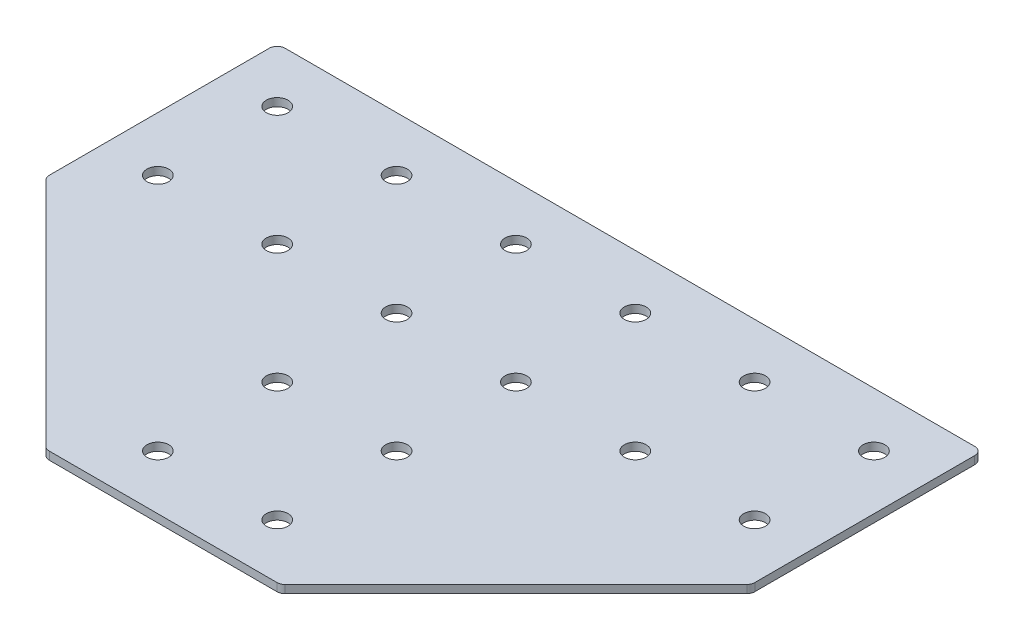
ISO-10303-21;
HEADER;
FILE_DESCRIPTION(('STEP AP214'),'2;1');
FILE_NAME('part.step','',(''),(''),'','','');
FILE_SCHEMA(('AUTOMOTIVE_DESIGN { 1 0 10303 214 1 1 1 1 }'));
ENDSEC;
DATA;
#1=APPLICATION_CONTEXT('core data for automotive mechanical design processes');
#2=APPLICATION_PROTOCOL_DEFINITION('international standard','automotive_design',2000,#1);
#3=PRODUCT_CONTEXT('',#1,'mechanical');
#4=PRODUCT('Part','Part','',(#3));
#5=PRODUCT_RELATED_PRODUCT_CATEGORY('part','',(#4));
#6=PRODUCT_DEFINITION_FORMATION('','',#4);
#7=PRODUCT_DEFINITION_CONTEXT('part definition',#1,'design');
#8=PRODUCT_DEFINITION('design','',#6,#7);
#9=PRODUCT_DEFINITION_SHAPE('','',#8);
#10=(LENGTH_UNIT() NAMED_UNIT(*) SI_UNIT(.MILLI.,.METRE.));
#11=(NAMED_UNIT(*) PLANE_ANGLE_UNIT() SI_UNIT($,.RADIAN.));
#12=(NAMED_UNIT(*) SI_UNIT($,.STERADIAN.) SOLID_ANGLE_UNIT());
#13=UNCERTAINTY_MEASURE_WITH_UNIT(LENGTH_MEASURE(1.E-05),#10,'distance_accuracy_value','');
#14=(GEOMETRIC_REPRESENTATION_CONTEXT(3) GLOBAL_UNCERTAINTY_ASSIGNED_CONTEXT((#13)) GLOBAL_UNIT_ASSIGNED_CONTEXT((#10,
#11,#12)) REPRESENTATION_CONTEXT('',''));
#15=CARTESIAN_POINT('',(0.,0.,0.));
#16=DIRECTION('',(0.,0.,1.));
#17=DIRECTION('',(1.,0.,0.));
#18=AXIS2_PLACEMENT_3D('',#15,#16,#17);
#19=CARTESIAN_POINT('',(-1.82872212002394,1.20798729377475,-45.8788250855786));
#20=DIRECTION('',(0.,-1.,0.));
#21=DIRECTION('',(0.,0.,-1.));
#22=AXIS2_PLACEMENT_3D('',#19,#20,#21);
#23=PLANE('',#22);
#24=DIRECTION('',(1.,0.,0.));
#25=VECTOR('',#24,1.);
#26=CARTESIAN_POINT('',(-44.828722120024,1.20798729377475,87.1211749144213));
#27=LINE('',#26,#25);
#28=CARTESIAN_POINT('',(-44.7576543081585,1.20798729377475,87.1211749144213));
#29=VERTEX_POINT('',#28);
#30=CARTESIAN_POINT('',(41.1002100681107,1.20798729377475,87.1211749144213));
#31=VERTEX_POINT('',#30);
#32=EDGE_CURVE('E218',#29,#31,#27,.T.);
#33=ORIENTED_EDGE('',*,*,#32,.F.);
#34=CARTESIAN_POINT('',(-44.7576543081585,1.20798729377475,84.1211749144213));
#35=DIRECTION('',(0.,1.,0.));
#36=DIRECTION('',(0.,0.,-1.));
#37=AXIS2_PLACEMENT_3D('',#34,#35,#36);
#38=CIRCLE('',#37,3.);
#39=CARTESIAN_POINT('',(-46.8789746517182,1.20798729377475,86.242495257981));
#40=VERTEX_POINT('',#39);
#41=EDGE_CURVE('E154',#40,#29,#38,.T.);
#42=ORIENTED_EDGE('',*,*,#41,.F.);
#43=DIRECTION('',(-0.707106781186547,0.,-0.707106781186548));
#44=VECTOR('',#43,1.);
#45=CARTESIAN_POINT('',(-46.0002949952778,1.20798729377475,87.1211749144213));
#46=LINE('',#45,#44);
#47=CARTESIAN_POINT('',(-133.950042463583,1.20798729377475,-0.828572553884362));
#48=VERTEX_POINT('',#47);
#49=EDGE_CURVE('E141',#40,#48,#46,.T.);
#50=ORIENTED_EDGE('',*,*,#49,.T.);
#51=CARTESIAN_POINT('',(-131.828722120024,1.20798729377475,-2.94989289744402));
#52=DIRECTION('',(0.,1.,0.));
#53=DIRECTION('',(0.,0.,-1.));
#54=AXIS2_PLACEMENT_3D('',#51,#52,#53);
#55=CIRCLE('',#54,3.);
#56=CARTESIAN_POINT('',(-134.828722120024,1.20798729377475,-2.94989289744401));
#57=VERTEX_POINT('',#56);
#58=EDGE_CURVE('E152',#57,#48,#55,.T.);
#59=ORIENTED_EDGE('',*,*,#58,.F.);
#60=DIRECTION('',(0.,0.,-1.));
#61=VECTOR('',#60,1.);
#62=CARTESIAN_POINT('',(-134.828722120024,1.20798729377475,-1.70725221032472));
#63=LINE('',#62,#61);
#64=CARTESIAN_POINT('',(-134.828722120024,1.20798729377475,-85.8788250855786));
#65=VERTEX_POINT('',#64);
#66=EDGE_CURVE('E124',#57,#65,#63,.T.);
#67=ORIENTED_EDGE('',*,*,#66,.T.);
#68=CARTESIAN_POINT('',(-131.828722120024,1.20798729377475,-85.8788250855787));
#69=DIRECTION('',(0.,1.,0.));
#70=DIRECTION('',(0.,0.,-1.));
#71=AXIS2_PLACEMENT_3D('',#68,#69,#70);
#72=CIRCLE('',#71,3.);
#73=CARTESIAN_POINT('',(-131.828722120024,1.20798729377475,-88.8788250855787));
#74=VERTEX_POINT('',#73);
#75=EDGE_CURVE('E149',#74,#65,#72,.T.);
#76=ORIENTED_EDGE('',*,*,#75,.F.);
#77=DIRECTION('',(-1.,0.,0.));
#78=VECTOR('',#77,1.);
#79=CARTESIAN_POINT('',(131.171277879976,1.20798729377475,-88.8788250855787));
#80=LINE('',#79,#78);
#81=CARTESIAN_POINT('',(128.171277879976,1.20798729377475,-88.8788250855787));
#82=VERTEX_POINT('',#81);
#83=EDGE_CURVE('E215',#82,#74,#80,.T.);
#84=ORIENTED_EDGE('',*,*,#83,.F.);
#85=CARTESIAN_POINT('',(128.171277879976,1.20798729377475,-85.8788250855787));
#86=DIRECTION('',(0.,-1.,0.));
#87=DIRECTION('',(0.,0.,-1.));
#88=AXIS2_PLACEMENT_3D('',#85,#86,#87);
#89=CIRCLE('',#88,3.);
#90=CARTESIAN_POINT('',(131.171277879976,1.20798729377475,-85.8788250855787));
#91=VERTEX_POINT('',#90);
#92=EDGE_CURVE('E239',#82,#91,#89,.T.);
#93=ORIENTED_EDGE('',*,*,#92,.T.);
#94=DIRECTION('',(0.,0.,-1.));
#95=VECTOR('',#94,1.);
#96=CARTESIAN_POINT('',(131.171277879976,1.20798729377475,-1.70725221032476));
#97=LINE('',#96,#95);
#98=CARTESIAN_POINT('',(131.171277879976,1.20798729377475,-2.94989289744405));
#99=VERTEX_POINT('',#98);
#100=EDGE_CURVE('E212',#99,#91,#97,.T.);
#101=ORIENTED_EDGE('',*,*,#100,.F.);
#102=CARTESIAN_POINT('',(128.171277879976,1.20798729377475,-2.94989289744405));
#103=DIRECTION('',(0.,-1.,0.));
#104=DIRECTION('',(0.,0.,-1.));
#105=AXIS2_PLACEMENT_3D('',#102,#103,#104);
#106=CIRCLE('',#105,3.);
#107=CARTESIAN_POINT('',(130.292598223536,1.20798729377475,-0.828572553884396));
#108=VERTEX_POINT('',#107);
#109=EDGE_CURVE('E31',#99,#108,#106,.T.);
#110=ORIENTED_EDGE('',*,*,#109,.T.);
#111=DIRECTION('',(0.707106781186547,0.,-0.707106781186548));
#112=VECTOR('',#111,1.);
#113=CARTESIAN_POINT('',(42.34285075523,1.20798729377475,87.1211749144213));
#114=LINE('',#113,#112);
#115=CARTESIAN_POINT('',(43.2215304116703,1.20798729377475,86.242495257981));
#116=VERTEX_POINT('',#115);
#117=EDGE_CURVE('E220',#116,#108,#114,.T.);
#118=ORIENTED_EDGE('',*,*,#117,.F.);
#119=CARTESIAN_POINT('',(41.1002100681107,1.20798729377475,84.1211749144213));
#120=DIRECTION('',(0.,-1.,0.));
#121=DIRECTION('',(0.,0.,-1.));
#122=AXIS2_PLACEMENT_3D('',#119,#120,#121);
#123=CIRCLE('',#122,3.);
#124=EDGE_CURVE('E242',#116,#31,#123,.T.);
#125=ORIENTED_EDGE('',*,*,#124,.T.);
#126=EDGE_LOOP('',(#33,#42,#50,#59,#67,#76,#84,#93,#101,#110,#118,#125));
#127=FACE_BOUND('',#126,.T.);
#128=CARTESIAN_POINT('',(110.671277879976,1.20798729377475,-23.3788250855786));
#129=DIRECTION('',(0.,1.,0.));
#130=DIRECTION('',(0.,0.,1.));
#131=AXIS2_PLACEMENT_3D('',#128,#129,#130);
#132=CIRCLE('',#131,4.1);
#133=CARTESIAN_POINT('',(110.671277879976,1.20798729377475,-19.2788250855786));
#134=VERTEX_POINT('',#133);
#135=EDGE_CURVE('E164',#134,#134,#132,.T.);
#136=ORIENTED_EDGE('',*,*,#135,.T.);
#137=EDGE_LOOP('',(#136));
#138=FACE_BOUND('',#137,.T.);
#139=CARTESIAN_POINT('',(65.671277879976,1.20798729377475,-23.3788250855786));
#140=DIRECTION('',(0.,1.,0.));
#141=DIRECTION('',(0.,0.,1.));
#142=AXIS2_PLACEMENT_3D('',#139,#140,#141);
#143=CIRCLE('',#142,4.09999999999999);
#144=CARTESIAN_POINT('',(65.671277879976,1.20798729377475,-19.2788250855787));
#145=VERTEX_POINT('',#144);
#146=EDGE_CURVE('E170',#145,#145,#143,.T.);
#147=ORIENTED_EDGE('',*,*,#146,.T.);
#148=EDGE_LOOP('',(#147));
#149=FACE_BOUND('',#148,.T.);
#150=CARTESIAN_POINT('',(20.6712778799761,1.20798729377475,66.6211749144214));
#151=DIRECTION('',(0.,1.,0.));
#152=DIRECTION('',(0.,0.,1.));
#153=AXIS2_PLACEMENT_3D('',#150,#151,#152);
#154=CIRCLE('',#153,4.1);
#155=CARTESIAN_POINT('',(20.6712778799761,1.20798729377475,70.7211749144214));
#156=VERTEX_POINT('',#155);
#157=EDGE_CURVE('E176',#156,#156,#154,.T.);
#158=ORIENTED_EDGE('',*,*,#157,.T.);
#159=EDGE_LOOP('',(#158));
#160=FACE_BOUND('',#159,.T.);
#161=CARTESIAN_POINT('',(20.6712778799761,1.20798729377475,21.6211749144214));
#162=DIRECTION('',(0.,1.,0.));
#163=DIRECTION('',(0.,0.,1.));
#164=AXIS2_PLACEMENT_3D('',#161,#162,#163);
#165=CIRCLE('',#164,4.1);
#166=CARTESIAN_POINT('',(20.6712778799761,1.20798729377475,25.7211749144214));
#167=VERTEX_POINT('',#166);
#168=EDGE_CURVE('E182',#167,#167,#165,.T.);
#169=ORIENTED_EDGE('',*,*,#168,.T.);
#170=EDGE_LOOP('',(#169));
#171=FACE_BOUND('',#170,.T.);
#172=CARTESIAN_POINT('',(20.671277879976,1.20798729377475,-23.3788250855786));
#173=DIRECTION('',(0.,1.,0.));
#174=DIRECTION('',(0.,0.,1.));
#175=AXIS2_PLACEMENT_3D('',#172,#173,#174);
#176=CIRCLE('',#175,4.1);
#177=CARTESIAN_POINT('',(20.671277879976,1.20798729377475,-19.2788250855786));
#178=VERTEX_POINT('',#177);
#179=EDGE_CURVE('E188',#178,#178,#176,.T.);
#180=ORIENTED_EDGE('',*,*,#179,.T.);
#181=EDGE_LOOP('',(#180));
#182=FACE_BOUND('',#181,.T.);
#183=CARTESIAN_POINT('',(110.671277879976,1.20798729377475,-68.3788250855786));
#184=DIRECTION('',(0.,1.,0.));
#185=DIRECTION('',(0.,0.,1.));
#186=AXIS2_PLACEMENT_3D('',#183,#184,#185);
#187=CIRCLE('',#186,4.09999999999999);
#188=CARTESIAN_POINT('',(110.671277879976,1.20798729377475,-64.2788250855786));
#189=VERTEX_POINT('',#188);
#190=EDGE_CURVE('E194',#189,#189,#187,.T.);
#191=ORIENTED_EDGE('',*,*,#190,.T.);
#192=EDGE_LOOP('',(#191));
#193=FACE_BOUND('',#192,.T.);
#194=CARTESIAN_POINT('',(65.671277879976,1.20798729377475,-68.3788250855786));
#195=DIRECTION('',(0.,1.,0.));
#196=DIRECTION('',(0.,0.,1.));
#197=AXIS2_PLACEMENT_3D('',#194,#195,#196);
#198=CIRCLE('',#197,4.09999999999999);
#199=CARTESIAN_POINT('',(65.671277879976,1.20798729377475,-64.2788250855786));
#200=VERTEX_POINT('',#199);
#201=EDGE_CURVE('E200',#200,#200,#198,.T.);
#202=ORIENTED_EDGE('',*,*,#201,.T.);
#203=EDGE_LOOP('',(#202));
#204=FACE_BOUND('',#203,.T.);
#205=CARTESIAN_POINT('',(20.671277879976,1.20798729377475,-68.3788250855786));
#206=DIRECTION('',(0.,1.,0.));
#207=DIRECTION('',(0.,0.,1.));
#208=AXIS2_PLACEMENT_3D('',#205,#206,#207);
#209=CIRCLE('',#208,4.1);
#210=CARTESIAN_POINT('',(20.671277879976,1.20798729377475,-64.2788250855786));
#211=VERTEX_POINT('',#210);
#212=EDGE_CURVE('E206',#211,#211,#209,.T.);
#213=ORIENTED_EDGE('',*,*,#212,.T.);
#214=EDGE_LOOP('',(#213));
#215=FACE_BOUND('',#214,.T.);
#216=CARTESIAN_POINT('',(-114.328722120024,1.20798729377475,-23.3788250855786));
#217=DIRECTION('',(0.,-1.,0.));
#218=DIRECTION('',(0.,0.,1.));
#219=AXIS2_PLACEMENT_3D('',#216,#217,#218);
#220=CIRCLE('',#219,4.1);
#221=CARTESIAN_POINT('',(-114.328722120024,1.20798729377475,-19.2788250855786));
#222=VERTEX_POINT('',#221);
#223=EDGE_CURVE('E318',#222,#222,#220,.T.);
#224=ORIENTED_EDGE('',*,*,#223,.F.);
#225=EDGE_LOOP('',(#224));
#226=FACE_BOUND('',#225,.T.);
#227=CARTESIAN_POINT('',(-69.3287221200239,1.20798729377475,-23.3788250855786));
#228=DIRECTION('',(0.,-1.,0.));
#229=DIRECTION('',(0.,0.,1.));
#230=AXIS2_PLACEMENT_3D('',#227,#228,#229);
#231=CIRCLE('',#230,4.09999999999999);
#232=CARTESIAN_POINT('',(-69.3287221200239,1.20798729377475,-19.2788250855786));
#233=VERTEX_POINT('',#232);
#234=EDGE_CURVE('E312',#233,#233,#231,.T.);
#235=ORIENTED_EDGE('',*,*,#234,.F.);
#236=EDGE_LOOP('',(#235));
#237=FACE_BOUND('',#236,.T.);
#238=CARTESIAN_POINT('',(-24.3287221200239,1.20798729377475,66.6211749144214));
#239=DIRECTION('',(0.,-1.,0.));
#240=DIRECTION('',(0.,0.,1.));
#241=AXIS2_PLACEMENT_3D('',#238,#239,#240);
#242=CIRCLE('',#241,4.1);
#243=CARTESIAN_POINT('',(-24.3287221200239,1.20798729377475,70.7211749144214));
#244=VERTEX_POINT('',#243);
#245=EDGE_CURVE('E306',#244,#244,#242,.T.);
#246=ORIENTED_EDGE('',*,*,#245,.F.);
#247=EDGE_LOOP('',(#246));
#248=FACE_BOUND('',#247,.T.);
#249=CARTESIAN_POINT('',(-24.3287221200239,1.20798729377475,21.6211749144214));
#250=DIRECTION('',(0.,-1.,0.));
#251=DIRECTION('',(0.,0.,1.));
#252=AXIS2_PLACEMENT_3D('',#249,#250,#251);
#253=CIRCLE('',#252,4.1);
#254=CARTESIAN_POINT('',(-24.3287221200239,1.20798729377475,25.7211749144214));
#255=VERTEX_POINT('',#254);
#256=EDGE_CURVE('E300',#255,#255,#253,.T.);
#257=ORIENTED_EDGE('',*,*,#256,.F.);
#258=EDGE_LOOP('',(#257));
#259=FACE_BOUND('',#258,.T.);
#260=CARTESIAN_POINT('',(-24.3287221200239,1.20798729377475,-23.3788250855786));
#261=DIRECTION('',(0.,-1.,0.));
#262=DIRECTION('',(0.,0.,1.));
#263=AXIS2_PLACEMENT_3D('',#260,#261,#262);
#264=CIRCLE('',#263,4.1);
#265=CARTESIAN_POINT('',(-24.3287221200239,1.20798729377475,-19.2788250855786));
#266=VERTEX_POINT('',#265);
#267=EDGE_CURVE('E294',#266,#266,#264,.T.);
#268=ORIENTED_EDGE('',*,*,#267,.F.);
#269=EDGE_LOOP('',(#268));
#270=FACE_BOUND('',#269,.T.);
#271=CARTESIAN_POINT('',(-114.328722120024,1.20798729377475,-68.3788250855786));
#272=DIRECTION('',(0.,-1.,0.));
#273=DIRECTION('',(0.,0.,1.));
#274=AXIS2_PLACEMENT_3D('',#271,#272,#273);
#275=CIRCLE('',#274,4.09999999999999);
#276=CARTESIAN_POINT('',(-114.328722120024,1.20798729377475,-64.2788250855786));
#277=VERTEX_POINT('',#276);
#278=EDGE_CURVE('E288',#277,#277,#275,.T.);
#279=ORIENTED_EDGE('',*,*,#278,.F.);
#280=EDGE_LOOP('',(#279));
#281=FACE_BOUND('',#280,.T.);
#282=CARTESIAN_POINT('',(-69.3287221200239,1.20798729377475,-68.3788250855786));
#283=DIRECTION('',(0.,-1.,0.));
#284=DIRECTION('',(0.,0.,1.));
#285=AXIS2_PLACEMENT_3D('',#282,#283,#284);
#286=CIRCLE('',#285,4.09999999999999);
#287=CARTESIAN_POINT('',(-69.3287221200239,1.20798729377475,-64.2788250855786));
#288=VERTEX_POINT('',#287);
#289=EDGE_CURVE('E283',#288,#288,#286,.T.);
#290=ORIENTED_EDGE('',*,*,#289,.F.);
#291=EDGE_LOOP('',(#290));
#292=FACE_BOUND('',#291,.T.);
#293=CARTESIAN_POINT('',(-24.3287221200239,1.20798729377475,-68.3788250855786));
#294=DIRECTION('',(0.,-1.,0.));
#295=DIRECTION('',(0.,0.,1.));
#296=AXIS2_PLACEMENT_3D('',#293,#294,#295);
#297=CIRCLE('',#296,4.1);
#298=CARTESIAN_POINT('',(-24.3287221200239,1.20798729377475,-64.2788250855786));
#299=VERTEX_POINT('',#298);
#300=EDGE_CURVE('E134',#299,#299,#297,.T.);
#301=ORIENTED_EDGE('',*,*,#300,.F.);
#302=EDGE_LOOP('',(#301));
#303=FACE_BOUND('',#302,.T.);
#304=ADVANCED_FACE('F16',(#127,#138,#149,#160,#171,#182,#193,#204,#215,#226,#237,#248,#259,#270,
#281,#292,#303),#23,.T.);
#305=CARTESIAN_POINT('',(131.171277879976,1.20798729377475,-1.70725221032476));
#306=DIRECTION('',(1.,0.,0.));
#307=DIRECTION('',(0.,0.,-1.));
#308=AXIS2_PLACEMENT_3D('',#305,#306,#307);
#309=PLANE('',#308);
#310=DIRECTION('',(0.,0.,-1.));
#311=VECTOR('',#310,1.);
#312=CARTESIAN_POINT('',(131.171277879976,4.20798729377475,-1.70725221032476));
#313=LINE('',#312,#311);
#314=CARTESIAN_POINT('',(131.171277879976,4.20798729377475,-2.94989289744405));
#315=VERTEX_POINT('',#314);
#316=CARTESIAN_POINT('',(131.171277879976,4.20798729377475,-85.8788250855787));
#317=VERTEX_POINT('',#316);
#318=EDGE_CURVE('E209',#315,#317,#313,.T.);
#319=ORIENTED_EDGE('',*,*,#318,.F.);
#320=DIRECTION('',(0.,1.,0.));
#321=VECTOR('',#320,1.);
#322=CARTESIAN_POINT('',(131.171277879976,1.20798729377475,-2.94989289744405));
#323=LINE('',#322,#321);
#324=EDGE_CURVE('E24',#315,#99,#323,.F.);
#325=ORIENTED_EDGE('',*,*,#324,.T.);
#326=ORIENTED_EDGE('',*,*,#100,.T.);
#327=DIRECTION('',(0.,1.,0.));
#328=VECTOR('',#327,1.);
#329=CARTESIAN_POINT('',(131.171277879976,1.20798729377475,-85.8788250855787));
#330=LINE('',#329,#328);
#331=EDGE_CURVE('E249',#91,#317,#330,.T.);
#332=ORIENTED_EDGE('',*,*,#331,.T.);
#333=EDGE_LOOP('',(#319,#325,#326,#332));
#334=FACE_BOUND('',#333,.T.);
#335=ADVANCED_FACE('F254',(#334),#309,.T.);
#336=CARTESIAN_POINT('',(42.34285075523,1.20798729377475,87.1211749144213));
#337=DIRECTION('',(0.707106781186548,0.,0.707106781186547));
#338=DIRECTION('',(0.707106781186547,0.,-0.707106781186548));
#339=AXIS2_PLACEMENT_3D('',#336,#337,#338);
#340=PLANE('',#339);
#341=DIRECTION('',(0.707106781186547,0.,-0.707106781186548));
#342=VECTOR('',#341,1.);
#343=CARTESIAN_POINT('',(42.34285075523,4.20798729377475,87.1211749144213));
#344=LINE('',#343,#342);
#345=CARTESIAN_POINT('',(43.2215304116703,4.20798729377475,86.242495257981));
#346=VERTEX_POINT('',#345);
#347=CARTESIAN_POINT('',(130.292598223536,4.20798729377475,-0.828572553884396));
#348=VERTEX_POINT('',#347);
#349=EDGE_CURVE('E216',#346,#348,#344,.T.);
#350=ORIENTED_EDGE('',*,*,#349,.F.);
#351=DIRECTION('',(0.,1.,0.));
#352=VECTOR('',#351,1.);
#353=CARTESIAN_POINT('',(43.2215304116703,1.20798729377475,86.242495257981));
#354=LINE('',#353,#352);
#355=EDGE_CURVE('E38',#346,#116,#354,.F.);
#356=ORIENTED_EDGE('',*,*,#355,.T.);
#357=ORIENTED_EDGE('',*,*,#117,.T.);
#358=DIRECTION('',(0.,1.,0.));
#359=VECTOR('',#358,1.);
#360=CARTESIAN_POINT('',(130.292598223536,1.20798729377475,-0.82857255388441));
#361=LINE('',#360,#359);
#362=EDGE_CURVE('E245',#108,#348,#361,.T.);
#363=ORIENTED_EDGE('',*,*,#362,.T.);
#364=EDGE_LOOP('',(#350,#356,#357,#363));
#365=FACE_BOUND('',#364,.T.);
#366=ADVANCED_FACE('F262',(#365),#340,.T.);
#367=CARTESIAN_POINT('',(-44.828722120024,1.20798729377475,87.1211749144213));
#368=DIRECTION('',(0.,0.,1.));
#369=DIRECTION('',(1.,0.,0.));
#370=AXIS2_PLACEMENT_3D('',#367,#368,#369);
#371=PLANE('',#370);
#372=DIRECTION('',(1.,0.,0.));
#373=VECTOR('',#372,1.);
#374=CARTESIAN_POINT('',(-44.828722120024,4.20798729377475,87.1211749144213));
#375=LINE('',#374,#373);
#376=CARTESIAN_POINT('',(-44.7576543081585,4.20798729377475,87.1211749144213));
#377=VERTEX_POINT('',#376);
#378=CARTESIAN_POINT('',(41.1002100681107,4.20798729377475,87.1211749144213));
#379=VERTEX_POINT('',#378);
#380=EDGE_CURVE('E227',#377,#379,#375,.T.);
#381=ORIENTED_EDGE('',*,*,#380,.F.);
#382=DIRECTION('',(0.,1.,0.));
#383=VECTOR('',#382,1.);
#384=CARTESIAN_POINT('',(-44.7576543081585,1.20798729377475,87.1211749144213));
#385=LINE('',#384,#383);
#386=EDGE_CURVE('E146',#29,#377,#385,.T.);
#387=ORIENTED_EDGE('',*,*,#386,.F.);
#388=ORIENTED_EDGE('',*,*,#32,.T.);
#389=DIRECTION('',(0.,1.,0.));
#390=VECTOR('',#389,1.);
#391=CARTESIAN_POINT('',(41.1002100681107,1.20798729377475,87.1211749144213));
#392=LINE('',#391,#390);
#393=EDGE_CURVE('E236',#31,#379,#392,.T.);
#394=ORIENTED_EDGE('',*,*,#393,.T.);
#395=EDGE_LOOP('',(#381,#387,#388,#394));
#396=FACE_BOUND('',#395,.T.);
#397=ADVANCED_FACE('F270',(#396),#371,.T.);
#398=CARTESIAN_POINT('',(131.171277879976,1.20798729377475,-88.8788250855787));
#399=DIRECTION('',(0.,0.,-1.));
#400=DIRECTION('',(-1.,0.,0.));
#401=AXIS2_PLACEMENT_3D('',#398,#399,#400);
#402=PLANE('',#401);
#403=ORIENTED_EDGE('',*,*,#83,.T.);
#404=DIRECTION('',(0.,1.,0.));
#405=VECTOR('',#404,1.);
#406=CARTESIAN_POINT('',(-131.828722120024,1.20798729377475,-88.8788250855787));
#407=LINE('',#406,#405);
#408=CARTESIAN_POINT('',(-131.828722120024,4.20798729377475,-88.8788250855787));
#409=VERTEX_POINT('',#408);
#410=EDGE_CURVE('E126',#409,#74,#407,.F.);
#411=ORIENTED_EDGE('',*,*,#410,.F.);
#412=DIRECTION('',(-1.,0.,0.));
#413=VECTOR('',#412,1.);
#414=CARTESIAN_POINT('',(131.171277879976,4.20798729377475,-88.8788250855787));
#415=LINE('',#414,#413);
#416=CARTESIAN_POINT('',(128.171277879976,4.20798729377475,-88.8788250855787));
#417=VERTEX_POINT('',#416);
#418=EDGE_CURVE('E225',#417,#409,#415,.T.);
#419=ORIENTED_EDGE('',*,*,#418,.F.);
#420=DIRECTION('',(0.,1.,0.));
#421=VECTOR('',#420,1.);
#422=CARTESIAN_POINT('',(128.171277879976,1.20798729377475,-88.8788250855787));
#423=LINE('',#422,#421);
#424=EDGE_CURVE('E10',#417,#82,#423,.F.);
#425=ORIENTED_EDGE('',*,*,#424,.T.);
#426=EDGE_LOOP('',(#403,#411,#419,#425));
#427=FACE_BOUND('',#426,.T.);
#428=ADVANCED_FACE('F356',(#427),#402,.T.);
#429=CARTESIAN_POINT('',(-1.82872212002394,4.20798729377475,-45.8788250855786));
#430=DIRECTION('',(0.,-1.,0.));
#431=DIRECTION('',(0.,0.,-1.));
#432=AXIS2_PLACEMENT_3D('',#429,#430,#431);
#433=PLANE('',#432);
#434=CARTESIAN_POINT('',(110.671277879976,4.20798729377475,-23.3788250855786));
#435=DIRECTION('',(0.,1.,0.));
#436=DIRECTION('',(0.,0.,1.));
#437=AXIS2_PLACEMENT_3D('',#434,#435,#436);
#438=CIRCLE('',#437,4.1);
#439=CARTESIAN_POINT('',(110.671277879976,4.20798729377475,-19.2788250855786));
#440=VERTEX_POINT('',#439);
#441=EDGE_CURVE('E163',#440,#440,#438,.T.);
#442=ORIENTED_EDGE('',*,*,#441,.F.);
#443=EDGE_LOOP('',(#442));
#444=FACE_BOUND('',#443,.T.);
#445=CARTESIAN_POINT('',(65.671277879976,4.20798729377475,-23.3788250855786));
#446=DIRECTION('',(0.,1.,0.));
#447=DIRECTION('',(0.,0.,1.));
#448=AXIS2_PLACEMENT_3D('',#445,#446,#447);
#449=CIRCLE('',#448,4.09999999999999);
#450=CARTESIAN_POINT('',(65.671277879976,4.20798729377475,-19.2788250855787));
#451=VERTEX_POINT('',#450);
#452=EDGE_CURVE('E167',#451,#451,#449,.T.);
#453=ORIENTED_EDGE('',*,*,#452,.F.);
#454=EDGE_LOOP('',(#453));
#455=FACE_BOUND('',#454,.T.);
#456=CARTESIAN_POINT('',(20.6712778799761,4.20798729377475,66.6211749144214));
#457=DIRECTION('',(0.,1.,0.));
#458=DIRECTION('',(0.,0.,1.));
#459=AXIS2_PLACEMENT_3D('',#456,#457,#458);
#460=CIRCLE('',#459,4.1);
#461=CARTESIAN_POINT('',(20.6712778799761,4.20798729377475,70.7211749144214));
#462=VERTEX_POINT('',#461);
#463=EDGE_CURVE('E173',#462,#462,#460,.T.);
#464=ORIENTED_EDGE('',*,*,#463,.F.);
#465=EDGE_LOOP('',(#464));
#466=FACE_BOUND('',#465,.T.);
#467=CARTESIAN_POINT('',(20.6712778799761,4.20798729377475,21.6211749144214));
#468=DIRECTION('',(0.,1.,0.));
#469=DIRECTION('',(0.,0.,1.));
#470=AXIS2_PLACEMENT_3D('',#467,#468,#469);
#471=CIRCLE('',#470,4.1);
#472=CARTESIAN_POINT('',(20.6712778799761,4.20798729377475,25.7211749144214));
#473=VERTEX_POINT('',#472);
#474=EDGE_CURVE('E179',#473,#473,#471,.T.);
#475=ORIENTED_EDGE('',*,*,#474,.F.);
#476=EDGE_LOOP('',(#475));
#477=FACE_BOUND('',#476,.T.);
#478=CARTESIAN_POINT('',(20.671277879976,4.20798729377475,-23.3788250855786));
#479=DIRECTION('',(0.,1.,0.));
#480=DIRECTION('',(0.,0.,1.));
#481=AXIS2_PLACEMENT_3D('',#478,#479,#480);
#482=CIRCLE('',#481,4.1);
#483=CARTESIAN_POINT('',(20.671277879976,4.20798729377475,-19.2788250855786));
#484=VERTEX_POINT('',#483);
#485=EDGE_CURVE('E185',#484,#484,#482,.T.);
#486=ORIENTED_EDGE('',*,*,#485,.F.);
#487=EDGE_LOOP('',(#486));
#488=FACE_BOUND('',#487,.T.);
#489=CARTESIAN_POINT('',(110.671277879976,4.20798729377475,-68.3788250855786));
#490=DIRECTION('',(0.,1.,0.));
#491=DIRECTION('',(0.,0.,1.));
#492=AXIS2_PLACEMENT_3D('',#489,#490,#491);
#493=CIRCLE('',#492,4.09999999999999);
#494=CARTESIAN_POINT('',(110.671277879976,4.20798729377475,-64.2788250855786));
#495=VERTEX_POINT('',#494);
#496=EDGE_CURVE('E191',#495,#495,#493,.T.);
#497=ORIENTED_EDGE('',*,*,#496,.F.);
#498=EDGE_LOOP('',(#497));
#499=FACE_BOUND('',#498,.T.);
#500=CARTESIAN_POINT('',(65.671277879976,4.20798729377475,-68.3788250855786));
#501=DIRECTION('',(0.,1.,0.));
#502=DIRECTION('',(0.,0.,1.));
#503=AXIS2_PLACEMENT_3D('',#500,#501,#502);
#504=CIRCLE('',#503,4.09999999999999);
#505=CARTESIAN_POINT('',(65.671277879976,4.20798729377475,-64.2788250855786));
#506=VERTEX_POINT('',#505);
#507=EDGE_CURVE('E197',#506,#506,#504,.T.);
#508=ORIENTED_EDGE('',*,*,#507,.F.);
#509=EDGE_LOOP('',(#508));
#510=FACE_BOUND('',#509,.T.);
#511=CARTESIAN_POINT('',(20.671277879976,4.20798729377475,-68.3788250855786));
#512=DIRECTION('',(0.,1.,0.));
#513=DIRECTION('',(0.,0.,1.));
#514=AXIS2_PLACEMENT_3D('',#511,#512,#513);
#515=CIRCLE('',#514,4.1);
#516=CARTESIAN_POINT('',(20.671277879976,4.20798729377475,-64.2788250855786));
#517=VERTEX_POINT('',#516);
#518=EDGE_CURVE('E203',#517,#517,#515,.T.);
#519=ORIENTED_EDGE('',*,*,#518,.F.);
#520=EDGE_LOOP('',(#519));
#521=FACE_BOUND('',#520,.T.);
#522=ORIENTED_EDGE('',*,*,#418,.T.);
#523=CARTESIAN_POINT('',(-131.828722120024,4.20798729377475,-85.8788250855787));
#524=DIRECTION('',(0.,1.,0.));
#525=DIRECTION('',(0.,0.,-1.));
#526=AXIS2_PLACEMENT_3D('',#523,#524,#525);
#527=CIRCLE('',#526,3.);
#528=CARTESIAN_POINT('',(-134.828722120024,4.20798729377475,-85.8788250855786));
#529=VERTEX_POINT('',#528);
#530=EDGE_CURVE('E117',#529,#409,#527,.F.);
#531=ORIENTED_EDGE('',*,*,#530,.F.);
#532=DIRECTION('',(0.,0.,-1.));
#533=VECTOR('',#532,1.);
#534=CARTESIAN_POINT('',(-134.828722120024,4.20798729377475,-1.70725221032472));
#535=LINE('',#534,#533);
#536=CARTESIAN_POINT('',(-134.828722120024,4.20798729377475,-2.94989289744401));
#537=VERTEX_POINT('',#536);
#538=EDGE_CURVE('E122',#537,#529,#535,.T.);
#539=ORIENTED_EDGE('',*,*,#538,.F.);
#540=CARTESIAN_POINT('',(-131.828722120024,4.20798729377475,-2.94989289744402));
#541=DIRECTION('',(0.,1.,0.));
#542=DIRECTION('',(0.,0.,-1.));
#543=AXIS2_PLACEMENT_3D('',#540,#541,#542);
#544=CIRCLE('',#543,3.);
#545=CARTESIAN_POINT('',(-133.950042463583,4.20798729377475,-0.828572553884362));
#546=VERTEX_POINT('',#545);
#547=EDGE_CURVE('E105',#546,#537,#544,.F.);
#548=ORIENTED_EDGE('',*,*,#547,.F.);
#549=DIRECTION('',(-0.707106781186547,0.,-0.707106781186548));
#550=VECTOR('',#549,1.);
#551=CARTESIAN_POINT('',(-46.0002949952778,4.20798729377475,87.1211749144213));
#552=LINE('',#551,#550);
#553=CARTESIAN_POINT('',(-46.8789746517182,4.20798729377475,86.242495257981));
#554=VERTEX_POINT('',#553);
#555=EDGE_CURVE('E133',#554,#546,#552,.T.);
#556=ORIENTED_EDGE('',*,*,#555,.F.);
#557=CARTESIAN_POINT('',(-44.7576543081585,4.20798729377475,84.1211749144213));
#558=DIRECTION('',(0.,1.,0.));
#559=DIRECTION('',(0.,0.,-1.));
#560=AXIS2_PLACEMENT_3D('',#557,#558,#559);
#561=CIRCLE('',#560,3.);
#562=EDGE_CURVE('E116',#377,#554,#561,.F.);
#563=ORIENTED_EDGE('',*,*,#562,.F.);
#564=ORIENTED_EDGE('',*,*,#380,.T.);
#565=CARTESIAN_POINT('',(41.1002100681107,4.20798729377475,84.1211749144213));
#566=DIRECTION('',(0.,-1.,0.));
#567=DIRECTION('',(0.,0.,-1.));
#568=AXIS2_PLACEMENT_3D('',#565,#566,#567);
#569=CIRCLE('',#568,3.);
#570=EDGE_CURVE('E234',#379,#346,#569,.F.);
#571=ORIENTED_EDGE('',*,*,#570,.T.);
#572=ORIENTED_EDGE('',*,*,#349,.T.);
#573=CARTESIAN_POINT('',(128.171277879976,4.20798729377475,-2.94989289744405));
#574=DIRECTION('',(0.,-1.,0.));
#575=DIRECTION('',(0.,0.,-1.));
#576=AXIS2_PLACEMENT_3D('',#573,#574,#575);
#577=CIRCLE('',#576,3.);
#578=EDGE_CURVE('E232',#348,#315,#577,.F.);
#579=ORIENTED_EDGE('',*,*,#578,.T.);
#580=ORIENTED_EDGE('',*,*,#318,.T.);
#581=CARTESIAN_POINT('',(128.171277879976,4.20798729377475,-85.8788250855787));
#582=DIRECTION('',(0.,-1.,0.));
#583=DIRECTION('',(0.,0.,-1.));
#584=AXIS2_PLACEMENT_3D('',#581,#582,#583);
#585=CIRCLE('',#584,3.);
#586=EDGE_CURVE('E222',#317,#417,#585,.F.);
#587=ORIENTED_EDGE('',*,*,#586,.T.);
#588=EDGE_LOOP('',(#522,#531,#539,#548,#556,#563,#564,#571,#572,#579,#580,#587));
#589=FACE_BOUND('',#588,.T.);
#590=CARTESIAN_POINT('',(-114.328722120024,4.20798729377475,-23.3788250855786));
#591=DIRECTION('',(0.,-1.,0.));
#592=DIRECTION('',(0.,0.,1.));
#593=AXIS2_PLACEMENT_3D('',#590,#591,#592);
#594=CIRCLE('',#593,4.1);
#595=CARTESIAN_POINT('',(-114.328722120024,4.20798729377475,-19.2788250855786));
#596=VERTEX_POINT('',#595);
#597=EDGE_CURVE('E321',#596,#596,#594,.T.);
#598=ORIENTED_EDGE('',*,*,#597,.T.);
#599=EDGE_LOOP('',(#598));
#600=FACE_BOUND('',#599,.T.);
#601=CARTESIAN_POINT('',(-69.3287221200239,4.20798729377475,-23.3788250855786));
#602=DIRECTION('',(0.,-1.,0.));
#603=DIRECTION('',(0.,0.,1.));
#604=AXIS2_PLACEMENT_3D('',#601,#602,#603);
#605=CIRCLE('',#604,4.09999999999999);
#606=CARTESIAN_POINT('',(-69.3287221200239,4.20798729377475,-19.2788250855786));
#607=VERTEX_POINT('',#606);
#608=EDGE_CURVE('E315',#607,#607,#605,.T.);
#609=ORIENTED_EDGE('',*,*,#608,.T.);
#610=EDGE_LOOP('',(#609));
#611=FACE_BOUND('',#610,.T.);
#612=CARTESIAN_POINT('',(-24.3287221200239,4.20798729377475,66.6211749144214));
#613=DIRECTION('',(0.,-1.,0.));
#614=DIRECTION('',(0.,0.,1.));
#615=AXIS2_PLACEMENT_3D('',#612,#613,#614);
#616=CIRCLE('',#615,4.1);
#617=CARTESIAN_POINT('',(-24.3287221200239,4.20798729377475,70.7211749144214));
#618=VERTEX_POINT('',#617);
#619=EDGE_CURVE('E309',#618,#618,#616,.T.);
#620=ORIENTED_EDGE('',*,*,#619,.T.);
#621=EDGE_LOOP('',(#620));
#622=FACE_BOUND('',#621,.T.);
#623=CARTESIAN_POINT('',(-24.3287221200239,4.20798729377475,21.6211749144214));
#624=DIRECTION('',(0.,-1.,0.));
#625=DIRECTION('',(0.,0.,1.));
#626=AXIS2_PLACEMENT_3D('',#623,#624,#625);
#627=CIRCLE('',#626,4.1);
#628=CARTESIAN_POINT('',(-24.3287221200239,4.20798729377475,25.7211749144214));
#629=VERTEX_POINT('',#628);
#630=EDGE_CURVE('E303',#629,#629,#627,.T.);
#631=ORIENTED_EDGE('',*,*,#630,.T.);
#632=EDGE_LOOP('',(#631));
#633=FACE_BOUND('',#632,.T.);
#634=CARTESIAN_POINT('',(-24.3287221200239,4.20798729377475,-23.3788250855786));
#635=DIRECTION('',(0.,-1.,0.));
#636=DIRECTION('',(0.,0.,1.));
#637=AXIS2_PLACEMENT_3D('',#634,#635,#636);
#638=CIRCLE('',#637,4.1);
#639=CARTESIAN_POINT('',(-24.3287221200239,4.20798729377475,-19.2788250855786));
#640=VERTEX_POINT('',#639);
#641=EDGE_CURVE('E297',#640,#640,#638,.T.);
#642=ORIENTED_EDGE('',*,*,#641,.T.);
#643=EDGE_LOOP('',(#642));
#644=FACE_BOUND('',#643,.T.);
#645=CARTESIAN_POINT('',(-114.328722120024,4.20798729377475,-68.3788250855786));
#646=DIRECTION('',(0.,-1.,0.));
#647=DIRECTION('',(0.,0.,1.));
#648=AXIS2_PLACEMENT_3D('',#645,#646,#647);
#649=CIRCLE('',#648,4.09999999999999);
#650=CARTESIAN_POINT('',(-114.328722120024,4.20798729377475,-64.2788250855786));
#651=VERTEX_POINT('',#650);
#652=EDGE_CURVE('E291',#651,#651,#649,.T.);
#653=ORIENTED_EDGE('',*,*,#652,.T.);
#654=EDGE_LOOP('',(#653));
#655=FACE_BOUND('',#654,.T.);
#656=CARTESIAN_POINT('',(-69.3287221200239,4.20798729377475,-68.3788250855786));
#657=DIRECTION('',(0.,-1.,0.));
#658=DIRECTION('',(0.,0.,1.));
#659=AXIS2_PLACEMENT_3D('',#656,#657,#658);
#660=CIRCLE('',#659,4.09999999999999);
#661=CARTESIAN_POINT('',(-69.3287221200239,4.20798729377475,-64.2788250855786));
#662=VERTEX_POINT('',#661);
#663=EDGE_CURVE('E285',#662,#662,#660,.T.);
#664=ORIENTED_EDGE('',*,*,#663,.T.);
#665=EDGE_LOOP('',(#664));
#666=FACE_BOUND('',#665,.T.);
#667=CARTESIAN_POINT('',(-24.3287221200239,4.20798729377475,-68.3788250855786));
#668=DIRECTION('',(0.,-1.,0.));
#669=DIRECTION('',(0.,0.,1.));
#670=AXIS2_PLACEMENT_3D('',#667,#668,#669);
#671=CIRCLE('',#670,4.1);
#672=CARTESIAN_POINT('',(-24.3287221200239,4.20798729377475,-64.2788250855786));
#673=VERTEX_POINT('',#672);
#674=EDGE_CURVE('E138',#673,#673,#671,.T.);
#675=ORIENTED_EDGE('',*,*,#674,.T.);
#676=EDGE_LOOP('',(#675));
#677=FACE_BOUND('',#676,.T.);
#678=ADVANCED_FACE('F129',(#444,#455,#466,#477,#488,#499,#510,#521,#589,#600,#611,#622,#633,
#644,#655,#666,#677),#433,.F.);
#679=CARTESIAN_POINT('',(41.1002100681107,1.20798729377475,84.1211749144213));
#680=DIRECTION('',(0.,1.,0.));
#681=DIRECTION('',(0.,0.,1.));
#682=AXIS2_PLACEMENT_3D('',#679,#680,#681);
#683=CYLINDRICAL_SURFACE('',#682,3.);
#684=ORIENTED_EDGE('',*,*,#124,.F.);
#685=ORIENTED_EDGE('',*,*,#355,.F.);
#686=ORIENTED_EDGE('',*,*,#570,.F.);
#687=ORIENTED_EDGE('',*,*,#393,.F.);
#688=EDGE_LOOP('',(#684,#685,#686,#687));
#689=FACE_BOUND('',#688,.T.);
#690=ADVANCED_FACE('F268',(#689),#683,.T.);
#691=CARTESIAN_POINT('',(128.171277879976,1.20798729377475,-2.94989289744405));
#692=DIRECTION('',(0.,1.,0.));
#693=DIRECTION('',(0.,0.,1.));
#694=AXIS2_PLACEMENT_3D('',#691,#692,#693);
#695=CYLINDRICAL_SURFACE('',#694,3.);
#696=ORIENTED_EDGE('',*,*,#109,.F.);
#697=ORIENTED_EDGE('',*,*,#324,.F.);
#698=ORIENTED_EDGE('',*,*,#578,.F.);
#699=ORIENTED_EDGE('',*,*,#362,.F.);
#700=EDGE_LOOP('',(#696,#697,#698,#699));
#701=FACE_BOUND('',#700,.T.);
#702=ADVANCED_FACE('F261',(#701),#695,.T.);
#703=CARTESIAN_POINT('',(128.171277879976,1.20798729377475,-85.8788250855787));
#704=DIRECTION('',(0.,1.,0.));
#705=DIRECTION('',(0.,0.,1.));
#706=AXIS2_PLACEMENT_3D('',#703,#704,#705);
#707=CYLINDRICAL_SURFACE('',#706,3.);
#708=ORIENTED_EDGE('',*,*,#92,.F.);
#709=ORIENTED_EDGE('',*,*,#424,.F.);
#710=ORIENTED_EDGE('',*,*,#586,.F.);
#711=ORIENTED_EDGE('',*,*,#331,.F.);
#712=EDGE_LOOP('',(#708,#709,#710,#711));
#713=FACE_BOUND('',#712,.T.);
#714=ADVANCED_FACE('F18',(#713),#707,.T.);
#715=CARTESIAN_POINT('',(20.671277879976,1.20798729377475,-68.3788250855786));
#716=DIRECTION('',(0.,1.,0.));
#717=DIRECTION('',(0.,0.,1.));
#718=AXIS2_PLACEMENT_3D('',#715,#716,#717);
#719=CYLINDRICAL_SURFACE('',#718,4.1);
#720=ORIENTED_EDGE('',*,*,#212,.F.);
#721=EDGE_LOOP('',(#720));
#722=FACE_BOUND('',#721,.T.);
#723=ORIENTED_EDGE('',*,*,#518,.T.);
#724=EDGE_LOOP('',(#723));
#725=FACE_BOUND('',#724,.T.);
#726=ADVANCED_FACE('F374',(#722,#725),#719,.F.);
#727=CARTESIAN_POINT('',(65.671277879976,1.20798729377475,-68.3788250855786));
#728=DIRECTION('',(0.,1.,0.));
#729=DIRECTION('',(0.,0.,1.));
#730=AXIS2_PLACEMENT_3D('',#727,#728,#729);
#731=CYLINDRICAL_SURFACE('',#730,4.09999999999999);
#732=ORIENTED_EDGE('',*,*,#201,.F.);
#733=EDGE_LOOP('',(#732));
#734=FACE_BOUND('',#733,.T.);
#735=ORIENTED_EDGE('',*,*,#507,.T.);
#736=EDGE_LOOP('',(#735));
#737=FACE_BOUND('',#736,.T.);
#738=ADVANCED_FACE('F379',(#734,#737),#731,.F.);
#739=CARTESIAN_POINT('',(110.671277879976,1.20798729377475,-68.3788250855786));
#740=DIRECTION('',(0.,1.,0.));
#741=DIRECTION('',(0.,0.,1.));
#742=AXIS2_PLACEMENT_3D('',#739,#740,#741);
#743=CYLINDRICAL_SURFACE('',#742,4.09999999999999);
#744=ORIENTED_EDGE('',*,*,#190,.F.);
#745=EDGE_LOOP('',(#744));
#746=FACE_BOUND('',#745,.T.);
#747=ORIENTED_EDGE('',*,*,#496,.T.);
#748=EDGE_LOOP('',(#747));
#749=FACE_BOUND('',#748,.T.);
#750=ADVANCED_FACE('F413',(#746,#749),#743,.F.);
#751=CARTESIAN_POINT('',(20.671277879976,1.20798729377475,-23.3788250855786));
#752=DIRECTION('',(0.,1.,0.));
#753=DIRECTION('',(0.,0.,1.));
#754=AXIS2_PLACEMENT_3D('',#751,#752,#753);
#755=CYLINDRICAL_SURFACE('',#754,4.1);
#756=ORIENTED_EDGE('',*,*,#179,.F.);
#757=EDGE_LOOP('',(#756));
#758=FACE_BOUND('',#757,.T.);
#759=ORIENTED_EDGE('',*,*,#485,.T.);
#760=EDGE_LOOP('',(#759));
#761=FACE_BOUND('',#760,.T.);
#762=ADVANCED_FACE('F409',(#758,#761),#755,.F.);
#763=CARTESIAN_POINT('',(20.6712778799761,1.20798729377475,21.6211749144214));
#764=DIRECTION('',(0.,1.,0.));
#765=DIRECTION('',(0.,0.,1.));
#766=AXIS2_PLACEMENT_3D('',#763,#764,#765);
#767=CYLINDRICAL_SURFACE('',#766,4.1);
#768=ORIENTED_EDGE('',*,*,#168,.F.);
#769=EDGE_LOOP('',(#768));
#770=FACE_BOUND('',#769,.T.);
#771=ORIENTED_EDGE('',*,*,#474,.T.);
#772=EDGE_LOOP('',(#771));
#773=FACE_BOUND('',#772,.T.);
#774=ADVANCED_FACE('F405',(#770,#773),#767,.F.);
#775=CARTESIAN_POINT('',(20.6712778799761,1.20798729377475,66.6211749144214));
#776=DIRECTION('',(0.,1.,0.));
#777=DIRECTION('',(0.,0.,1.));
#778=AXIS2_PLACEMENT_3D('',#775,#776,#777);
#779=CYLINDRICAL_SURFACE('',#778,4.1);
#780=ORIENTED_EDGE('',*,*,#157,.F.);
#781=EDGE_LOOP('',(#780));
#782=FACE_BOUND('',#781,.T.);
#783=ORIENTED_EDGE('',*,*,#463,.T.);
#784=EDGE_LOOP('',(#783));
#785=FACE_BOUND('',#784,.T.);
#786=ADVANCED_FACE('F401',(#782,#785),#779,.F.);
#787=CARTESIAN_POINT('',(65.671277879976,1.20798729377475,-23.3788250855786));
#788=DIRECTION('',(0.,1.,0.));
#789=DIRECTION('',(0.,0.,1.));
#790=AXIS2_PLACEMENT_3D('',#787,#788,#789);
#791=CYLINDRICAL_SURFACE('',#790,4.09999999999999);
#792=ORIENTED_EDGE('',*,*,#146,.F.);
#793=EDGE_LOOP('',(#792));
#794=FACE_BOUND('',#793,.T.);
#795=ORIENTED_EDGE('',*,*,#452,.T.);
#796=EDGE_LOOP('',(#795));
#797=FACE_BOUND('',#796,.T.);
#798=ADVANCED_FACE('F397',(#794,#797),#791,.F.);
#799=CARTESIAN_POINT('',(110.671277879976,1.20798729377475,-23.3788250855786));
#800=DIRECTION('',(0.,1.,0.));
#801=DIRECTION('',(0.,0.,1.));
#802=AXIS2_PLACEMENT_3D('',#799,#800,#801);
#803=CYLINDRICAL_SURFACE('',#802,4.1);
#804=ORIENTED_EDGE('',*,*,#135,.F.);
#805=EDGE_LOOP('',(#804));
#806=FACE_BOUND('',#805,.T.);
#807=ORIENTED_EDGE('',*,*,#441,.T.);
#808=EDGE_LOOP('',(#807));
#809=FACE_BOUND('',#808,.T.);
#810=ADVANCED_FACE('F394',(#806,#809),#803,.F.);
#811=CARTESIAN_POINT('',(-134.828722120024,1.20798729377475,-1.70725221032472));
#812=DIRECTION('',(-1.,0.,0.));
#813=DIRECTION('',(0.,0.,-1.));
#814=AXIS2_PLACEMENT_3D('',#811,#812,#813);
#815=PLANE('',#814);
#816=ORIENTED_EDGE('',*,*,#538,.T.);
#817=DIRECTION('',(0.,1.,0.));
#818=VECTOR('',#817,1.);
#819=CARTESIAN_POINT('',(-134.828722120024,1.20798729377475,-85.8788250855787));
#820=LINE('',#819,#818);
#821=EDGE_CURVE('E127',#65,#529,#820,.T.);
#822=ORIENTED_EDGE('',*,*,#821,.F.);
#823=ORIENTED_EDGE('',*,*,#66,.F.);
#824=DIRECTION('',(0.,1.,0.));
#825=VECTOR('',#824,1.);
#826=CARTESIAN_POINT('',(-134.828722120024,1.20798729377475,-2.94989289744401));
#827=LINE('',#826,#825);
#828=EDGE_CURVE('E109',#537,#57,#827,.F.);
#829=ORIENTED_EDGE('',*,*,#828,.F.);
#830=EDGE_LOOP('',(#816,#822,#823,#829));
#831=FACE_BOUND('',#830,.T.);
#832=ADVANCED_FACE('F121',(#831),#815,.T.);
#833=CARTESIAN_POINT('',(-46.0002949952778,1.20798729377475,87.1211749144213));
#834=DIRECTION('',(-0.707106781186548,0.,0.707106781186547));
#835=DIRECTION('',(-0.707106781186547,0.,-0.707106781186548));
#836=AXIS2_PLACEMENT_3D('',#833,#834,#835);
#837=PLANE('',#836);
#838=ORIENTED_EDGE('',*,*,#555,.T.);
#839=DIRECTION('',(0.,1.,0.));
#840=VECTOR('',#839,1.);
#841=CARTESIAN_POINT('',(-133.950042463583,1.20798729377475,-0.828572553884376));
#842=LINE('',#841,#840);
#843=EDGE_CURVE('E111',#48,#546,#842,.T.);
#844=ORIENTED_EDGE('',*,*,#843,.F.);
#845=ORIENTED_EDGE('',*,*,#49,.F.);
#846=DIRECTION('',(0.,1.,0.));
#847=VECTOR('',#846,1.);
#848=CARTESIAN_POINT('',(-46.8789746517182,1.20798729377475,86.242495257981));
#849=LINE('',#848,#847);
#850=EDGE_CURVE('E158',#554,#40,#849,.F.);
#851=ORIENTED_EDGE('',*,*,#850,.F.);
#852=EDGE_LOOP('',(#838,#844,#845,#851));
#853=FACE_BOUND('',#852,.T.);
#854=ADVANCED_FACE('F279',(#853),#837,.T.);
#855=CARTESIAN_POINT('',(-44.7576543081585,1.20798729377475,84.1211749144213));
#856=DIRECTION('',(0.,1.,0.));
#857=DIRECTION('',(0.,0.,1.));
#858=AXIS2_PLACEMENT_3D('',#855,#856,#857);
#859=CYLINDRICAL_SURFACE('',#858,3.);
#860=ORIENTED_EDGE('',*,*,#41,.T.);
#861=ORIENTED_EDGE('',*,*,#386,.T.);
#862=ORIENTED_EDGE('',*,*,#562,.T.);
#863=ORIENTED_EDGE('',*,*,#850,.T.);
#864=EDGE_LOOP('',(#860,#861,#862,#863));
#865=FACE_BOUND('',#864,.T.);
#866=ADVANCED_FACE('F276',(#865),#859,.T.);
#867=CARTESIAN_POINT('',(-131.828722120024,1.20798729377475,-2.94989289744402));
#868=DIRECTION('',(0.,1.,0.));
#869=DIRECTION('',(0.,0.,1.));
#870=AXIS2_PLACEMENT_3D('',#867,#868,#869);
#871=CYLINDRICAL_SURFACE('',#870,3.);
#872=ORIENTED_EDGE('',*,*,#58,.T.);
#873=ORIENTED_EDGE('',*,*,#843,.T.);
#874=ORIENTED_EDGE('',*,*,#547,.T.);
#875=ORIENTED_EDGE('',*,*,#828,.T.);
#876=EDGE_LOOP('',(#872,#873,#874,#875));
#877=FACE_BOUND('',#876,.T.);
#878=ADVANCED_FACE('F108',(#877),#871,.T.);
#879=CARTESIAN_POINT('',(-131.828722120024,1.20798729377475,-85.8788250855787));
#880=DIRECTION('',(0.,1.,0.));
#881=DIRECTION('',(0.,0.,1.));
#882=AXIS2_PLACEMENT_3D('',#879,#880,#881);
#883=CYLINDRICAL_SURFACE('',#882,3.);
#884=ORIENTED_EDGE('',*,*,#75,.T.);
#885=ORIENTED_EDGE('',*,*,#821,.T.);
#886=ORIENTED_EDGE('',*,*,#530,.T.);
#887=ORIENTED_EDGE('',*,*,#410,.T.);
#888=EDGE_LOOP('',(#884,#885,#886,#887));
#889=FACE_BOUND('',#888,.T.);
#890=ADVANCED_FACE('F351',(#889),#883,.T.);
#891=CARTESIAN_POINT('',(-24.3287221200239,1.20798729377475,-68.3788250855786));
#892=DIRECTION('',(0.,1.,0.));
#893=DIRECTION('',(0.,0.,1.));
#894=AXIS2_PLACEMENT_3D('',#891,#892,#893);
#895=CYLINDRICAL_SURFACE('',#894,4.1);
#896=ORIENTED_EDGE('',*,*,#300,.T.);
#897=EDGE_LOOP('',(#896));
#898=FACE_BOUND('',#897,.T.);
#899=ORIENTED_EDGE('',*,*,#674,.F.);
#900=EDGE_LOOP('',(#899));
#901=FACE_BOUND('',#900,.T.);
#902=ADVANCED_FACE('F347',(#898,#901),#895,.F.);
#903=CARTESIAN_POINT('',(-69.3287221200239,1.20798729377475,-68.3788250855786));
#904=DIRECTION('',(0.,1.,0.));
#905=DIRECTION('',(0.,0.,1.));
#906=AXIS2_PLACEMENT_3D('',#903,#904,#905);
#907=CYLINDRICAL_SURFACE('',#906,4.09999999999999);
#908=ORIENTED_EDGE('',*,*,#289,.T.);
#909=EDGE_LOOP('',(#908));
#910=FACE_BOUND('',#909,.T.);
#911=ORIENTED_EDGE('',*,*,#663,.F.);
#912=EDGE_LOOP('',(#911));
#913=FACE_BOUND('',#912,.T.);
#914=ADVANCED_FACE('F350',(#910,#913),#907,.F.);
#915=CARTESIAN_POINT('',(-114.328722120024,1.20798729377475,-68.3788250855786));
#916=DIRECTION('',(0.,1.,0.));
#917=DIRECTION('',(0.,0.,1.));
#918=AXIS2_PLACEMENT_3D('',#915,#916,#917);
#919=CYLINDRICAL_SURFACE('',#918,4.09999999999999);
#920=ORIENTED_EDGE('',*,*,#278,.T.);
#921=EDGE_LOOP('',(#920));
#922=FACE_BOUND('',#921,.T.);
#923=ORIENTED_EDGE('',*,*,#652,.F.);
#924=EDGE_LOOP('',(#923));
#925=FACE_BOUND('',#924,.T.);
#926=ADVANCED_FACE('F552',(#922,#925),#919,.F.);
#927=CARTESIAN_POINT('',(-24.3287221200239,1.20798729377475,-23.3788250855786));
#928=DIRECTION('',(0.,1.,0.));
#929=DIRECTION('',(0.,0.,1.));
#930=AXIS2_PLACEMENT_3D('',#927,#928,#929);
#931=CYLINDRICAL_SURFACE('',#930,4.1);
#932=ORIENTED_EDGE('',*,*,#267,.T.);
#933=EDGE_LOOP('',(#932));
#934=FACE_BOUND('',#933,.T.);
#935=ORIENTED_EDGE('',*,*,#641,.F.);
#936=EDGE_LOOP('',(#935));
#937=FACE_BOUND('',#936,.T.);
#938=ADVANCED_FACE('F562',(#934,#937),#931,.F.);
#939=CARTESIAN_POINT('',(-24.3287221200239,1.20798729377475,21.6211749144214));
#940=DIRECTION('',(0.,1.,0.));
#941=DIRECTION('',(0.,0.,1.));
#942=AXIS2_PLACEMENT_3D('',#939,#940,#941);
#943=CYLINDRICAL_SURFACE('',#942,4.1);
#944=ORIENTED_EDGE('',*,*,#256,.T.);
#945=EDGE_LOOP('',(#944));
#946=FACE_BOUND('',#945,.T.);
#947=ORIENTED_EDGE('',*,*,#630,.F.);
#948=EDGE_LOOP('',(#947));
#949=FACE_BOUND('',#948,.T.);
#950=ADVANCED_FACE('F572',(#946,#949),#943,.F.);
#951=CARTESIAN_POINT('',(-24.3287221200239,1.20798729377475,66.6211749144214));
#952=DIRECTION('',(0.,1.,0.));
#953=DIRECTION('',(0.,0.,1.));
#954=AXIS2_PLACEMENT_3D('',#951,#952,#953);
#955=CYLINDRICAL_SURFACE('',#954,4.1);
#956=ORIENTED_EDGE('',*,*,#245,.T.);
#957=EDGE_LOOP('',(#956));
#958=FACE_BOUND('',#957,.T.);
#959=ORIENTED_EDGE('',*,*,#619,.F.);
#960=EDGE_LOOP('',(#959));
#961=FACE_BOUND('',#960,.T.);
#962=ADVANCED_FACE('F582',(#958,#961),#955,.F.);
#963=CARTESIAN_POINT('',(-69.3287221200239,1.20798729377475,-23.3788250855786));
#964=DIRECTION('',(0.,1.,0.));
#965=DIRECTION('',(0.,0.,1.));
#966=AXIS2_PLACEMENT_3D('',#963,#964,#965);
#967=CYLINDRICAL_SURFACE('',#966,4.09999999999999);
#968=ORIENTED_EDGE('',*,*,#234,.T.);
#969=EDGE_LOOP('',(#968));
#970=FACE_BOUND('',#969,.T.);
#971=ORIENTED_EDGE('',*,*,#608,.F.);
#972=EDGE_LOOP('',(#971));
#973=FACE_BOUND('',#972,.T.);
#974=ADVANCED_FACE('F592',(#970,#973),#967,.F.);
#975=CARTESIAN_POINT('',(-114.328722120024,1.20798729377475,-23.3788250855786));
#976=DIRECTION('',(0.,1.,0.));
#977=DIRECTION('',(0.,0.,1.));
#978=AXIS2_PLACEMENT_3D('',#975,#976,#977);
#979=CYLINDRICAL_SURFACE('',#978,4.1);
#980=ORIENTED_EDGE('',*,*,#223,.T.);
#981=EDGE_LOOP('',(#980));
#982=FACE_BOUND('',#981,.T.);
#983=ORIENTED_EDGE('',*,*,#597,.F.);
#984=EDGE_LOOP('',(#983));
#985=FACE_BOUND('',#984,.T.);
#986=ADVANCED_FACE('F327',(#982,#985),#979,.F.);
#987=CLOSED_SHELL('',(#304,#335,#366,#397,#428,#678,#690,#702,#714,#726,#738,#750,#762,#774,
#786,#798,#810,#832,#854,#866,#878,#890,#902,#914,#926,#938,#950,#962,#974,#986));
#988=MANIFOLD_SOLID_BREP('B1',#987);
#989=ADVANCED_BREP_SHAPE_REPRESENTATION('',(#18,#988),#14);
#990=SHAPE_DEFINITION_REPRESENTATION(#9,#989);
ENDSEC;
END-ISO-10303-21;
